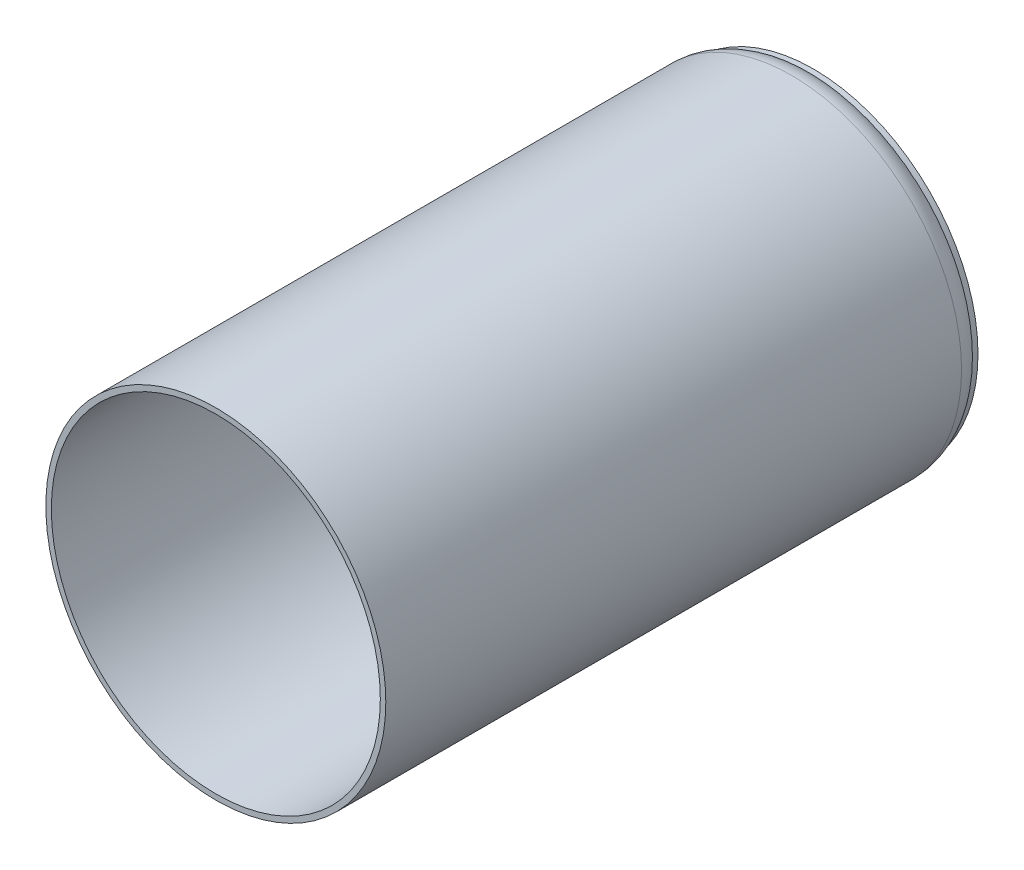
ISO-10303-21;
HEADER;
FILE_DESCRIPTION(('STEP AP214'),'2;1');
FILE_NAME('part.step','',(''),(''),'','','');
FILE_SCHEMA(('AUTOMOTIVE_DESIGN { 1 0 10303 214 1 1 1 1 }'));
ENDSEC;
DATA;
#1=APPLICATION_CONTEXT('core data for automotive mechanical design processes');
#2=APPLICATION_PROTOCOL_DEFINITION('international standard','automotive_design',2000,#1);
#3=PRODUCT_CONTEXT('',#1,'mechanical');
#4=PRODUCT('Part','Part','',(#3));
#5=PRODUCT_RELATED_PRODUCT_CATEGORY('part','',(#4));
#6=PRODUCT_DEFINITION_FORMATION('','',#4);
#7=PRODUCT_DEFINITION_CONTEXT('part definition',#1,'design');
#8=PRODUCT_DEFINITION('design','',#6,#7);
#9=PRODUCT_DEFINITION_SHAPE('','',#8);
#10=(LENGTH_UNIT() NAMED_UNIT(*) SI_UNIT(.MILLI.,.METRE.));
#11=(NAMED_UNIT(*) PLANE_ANGLE_UNIT() SI_UNIT($,.RADIAN.));
#12=(NAMED_UNIT(*) SI_UNIT($,.STERADIAN.) SOLID_ANGLE_UNIT());
#13=UNCERTAINTY_MEASURE_WITH_UNIT(LENGTH_MEASURE(1.E-05),#10,'distance_accuracy_value','');
#14=(GEOMETRIC_REPRESENTATION_CONTEXT(3) GLOBAL_UNCERTAINTY_ASSIGNED_CONTEXT((#13)) GLOBAL_UNIT_ASSIGNED_CONTEXT((#10,
#11,#12)) REPRESENTATION_CONTEXT('',''));
#15=CARTESIAN_POINT('',(0.,0.,0.));
#16=DIRECTION('',(0.,0.,1.));
#17=DIRECTION('',(1.,0.,0.));
#18=AXIS2_PLACEMENT_3D('',#15,#16,#17);
#19=CARTESIAN_POINT('',(-27.512537488204,7.3060700203578,110.));
#20=DIRECTION('',(0.,0.,-1.));
#21=DIRECTION('',(-1.,0.,0.));
#22=AXIS2_PLACEMENT_3D('',#19,#20,#21);
#23=CYLINDRICAL_SURFACE('',#22,31.);
#24=CARTESIAN_POINT('',(-27.512537488204,7.3060700203578,5.));
#25=DIRECTION('',(0.,0.,1.));
#26=DIRECTION('',(1.,0.,0.));
#27=AXIS2_PLACEMENT_3D('',#24,#25,#26);
#28=CIRCLE('',#27,31.);
#29=CARTESIAN_POINT('',(3.48746251179605,7.3060700203578,5.));
#30=VERTEX_POINT('',#29);
#31=EDGE_CURVE('E38',#30,#30,#28,.T.);
#32=ORIENTED_EDGE('',*,*,#31,.T.);
#33=EDGE_LOOP('',(#32));
#34=FACE_BOUND('',#33,.T.);
#35=CARTESIAN_POINT('',(-27.512537488204,7.3060700203578,110.));
#36=DIRECTION('',(0.,0.,1.));
#37=DIRECTION('',(1.,0.,0.));
#38=AXIS2_PLACEMENT_3D('',#35,#36,#37);
#39=CIRCLE('',#38,31.);
#40=CARTESIAN_POINT('',(3.48746251179605,7.3060700203578,110.));
#41=VERTEX_POINT('',#40);
#42=EDGE_CURVE('E42',#41,#41,#39,.T.);
#43=ORIENTED_EDGE('',*,*,#42,.F.);
#44=EDGE_LOOP('',(#43));
#45=FACE_BOUND('',#44,.T.);
#46=ADVANCED_FACE('F31',(#34,#45),#23,.T.);
#47=CARTESIAN_POINT('',(-27.512537488204,7.3060700203578,110.));
#48=DIRECTION('',(0.,0.,1.));
#49=DIRECTION('',(1.,0.,0.));
#50=AXIS2_PLACEMENT_3D('',#47,#48,#49);
#51=PLANE('',#50);
#52=CARTESIAN_POINT('',(-27.512537488204,7.3060700203578,110.));
#53=DIRECTION('',(0.,0.,1.));
#54=DIRECTION('',(1.,0.,0.));
#55=AXIS2_PLACEMENT_3D('',#52,#53,#54);
#56=CIRCLE('',#55,30.);
#57=CARTESIAN_POINT('',(2.48746251179605,7.3060700203578,110.));
#58=VERTEX_POINT('',#57);
#59=EDGE_CURVE('E46',#58,#58,#56,.T.);
#60=ORIENTED_EDGE('',*,*,#59,.F.);
#61=EDGE_LOOP('',(#60));
#62=FACE_BOUND('',#61,.T.);
#63=ORIENTED_EDGE('',*,*,#42,.T.);
#64=EDGE_LOOP('',(#63));
#65=FACE_BOUND('',#64,.T.);
#66=ADVANCED_FACE('F67',(#62,#65),#51,.T.);
#67=CARTESIAN_POINT('',(-27.512537488204,7.3060700203578,0.));
#68=DIRECTION('',(0.,0.,1.));
#69=DIRECTION('',(1.,0.,0.));
#70=AXIS2_PLACEMENT_3D('',#67,#68,#69);
#71=PLANE('',#70);
#72=CARTESIAN_POINT('',(-27.512537488204,7.3060700203578,0.));
#73=DIRECTION('',(0.,0.,1.));
#74=DIRECTION('',(1.,0.,0.));
#75=AXIS2_PLACEMENT_3D('',#72,#73,#74);
#76=CIRCLE('',#75,26.);
#77=CARTESIAN_POINT('',(-1.51253748820395,7.3060700203578,0.));
#78=VERTEX_POINT('',#77);
#79=EDGE_CURVE('E10',#78,#78,#76,.F.);
#80=ORIENTED_EDGE('',*,*,#79,.T.);
#81=EDGE_LOOP('',(#80));
#82=FACE_BOUND('',#81,.T.);
#83=ADVANCED_FACE('F59',(#82),#71,.F.);
#84=CARTESIAN_POINT('',(-27.512537488204,7.3060700203578,110.));
#85=DIRECTION('',(0.,0.,-1.));
#86=DIRECTION('',(-1.,0.,0.));
#87=AXIS2_PLACEMENT_3D('',#84,#85,#86);
#88=CYLINDRICAL_SURFACE('',#87,30.);
#89=ORIENTED_EDGE('',*,*,#59,.T.);
#90=EDGE_LOOP('',(#89));
#91=FACE_BOUND('',#90,.T.);
#92=CARTESIAN_POINT('',(-27.512537488204,7.3060700203578,1.));
#93=DIRECTION('',(0.,0.,1.));
#94=DIRECTION('',(1.,0.,0.));
#95=AXIS2_PLACEMENT_3D('',#92,#93,#94);
#96=CIRCLE('',#95,30.);
#97=CARTESIAN_POINT('',(2.48746251179605,7.3060700203578,1.));
#98=VERTEX_POINT('',#97);
#99=EDGE_CURVE('E51',#98,#98,#96,.T.);
#100=ORIENTED_EDGE('',*,*,#99,.F.);
#101=EDGE_LOOP('',(#100));
#102=FACE_BOUND('',#101,.T.);
#103=ADVANCED_FACE('F57',(#91,#102),#88,.F.);
#104=CARTESIAN_POINT('',(-27.512537488204,7.3060700203578,1.));
#105=DIRECTION('',(0.,0.,1.));
#106=DIRECTION('',(1.,0.,0.));
#107=AXIS2_PLACEMENT_3D('',#104,#105,#106);
#108=PLANE('',#107);
#109=ORIENTED_EDGE('',*,*,#99,.T.);
#110=EDGE_LOOP('',(#109));
#111=FACE_BOUND('',#110,.T.);
#112=ADVANCED_FACE('F55',(#111),#108,.T.);
#113=CARTESIAN_POINT('',(-27.512537488204,7.3060700203578,5.));
#114=DIRECTION('',(0.,0.,1.));
#115=DIRECTION('',(1.,0.,0.));
#116=AXIS2_PLACEMENT_3D('',#113,#114,#115);
#117=TOROIDAL_SURFACE('',#116,26.,5.);
#118=ORIENTED_EDGE('',*,*,#79,.F.);
#119=EDGE_LOOP('',(#118));
#120=FACE_BOUND('',#119,.T.);
#121=ORIENTED_EDGE('',*,*,#31,.F.);
#122=EDGE_LOOP('',(#121));
#123=FACE_BOUND('',#122,.T.);
#124=ADVANCED_FACE('F33',(#120,#123),#117,.T.);
#125=CLOSED_SHELL('',(#46,#66,#83,#103,#112,#124));
#126=MANIFOLD_SOLID_BREP('B2',#125);
#127=ADVANCED_BREP_SHAPE_REPRESENTATION('',(#18,#126),#14);
#128=SHAPE_DEFINITION_REPRESENTATION(#9,#127);
ENDSEC;
END-ISO-10303-21;
